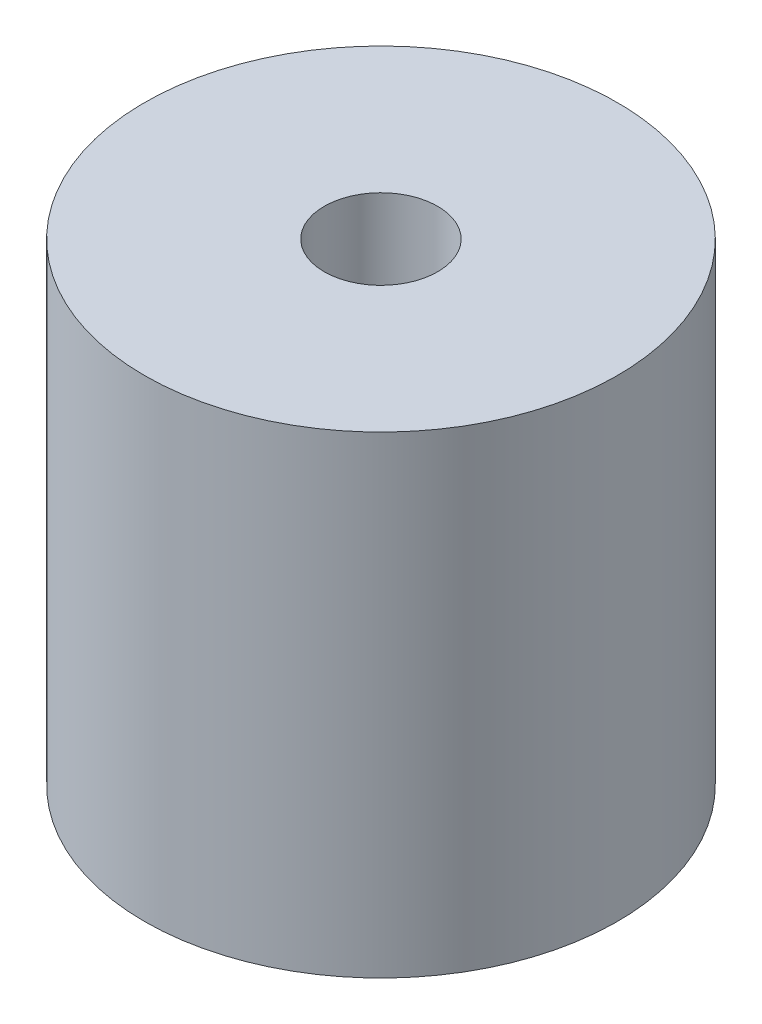
ISO-10303-21;
HEADER;
FILE_DESCRIPTION(('STEP AP214'),'2;1');
FILE_NAME('part.step','',(''),(''),'','','');
FILE_SCHEMA(('AUTOMOTIVE_DESIGN { 1 0 10303 214 1 1 1 1 }'));
ENDSEC;
DATA;
#1=APPLICATION_CONTEXT('core data for automotive mechanical design processes');
#2=APPLICATION_PROTOCOL_DEFINITION('international standard','automotive_design',2000,#1);
#3=PRODUCT_CONTEXT('',#1,'mechanical');
#4=PRODUCT('Part','Part','',(#3));
#5=PRODUCT_RELATED_PRODUCT_CATEGORY('part','',(#4));
#6=PRODUCT_DEFINITION_FORMATION('','',#4);
#7=PRODUCT_DEFINITION_CONTEXT('part definition',#1,'design');
#8=PRODUCT_DEFINITION('design','',#6,#7);
#9=PRODUCT_DEFINITION_SHAPE('','',#8);
#10=(LENGTH_UNIT() NAMED_UNIT(*) SI_UNIT(.MILLI.,.METRE.));
#11=(NAMED_UNIT(*) PLANE_ANGLE_UNIT() SI_UNIT($,.RADIAN.));
#12=(NAMED_UNIT(*) SI_UNIT($,.STERADIAN.) SOLID_ANGLE_UNIT());
#13=UNCERTAINTY_MEASURE_WITH_UNIT(LENGTH_MEASURE(1.E-05),#10,'distance_accuracy_value','');
#14=(GEOMETRIC_REPRESENTATION_CONTEXT(3) GLOBAL_UNCERTAINTY_ASSIGNED_CONTEXT((#13)) GLOBAL_UNIT_ASSIGNED_CONTEXT((#10,
#11,#12)) REPRESENTATION_CONTEXT('',''));
#15=CARTESIAN_POINT('',(0.,0.,0.));
#16=DIRECTION('',(0.,0.,1.));
#17=DIRECTION('',(1.,0.,0.));
#18=AXIS2_PLACEMENT_3D('',#15,#16,#17);
#19=CARTESIAN_POINT('',(0.,35.,0.));
#20=DIRECTION('',(0.,-1.,0.));
#21=DIRECTION('',(0.,0.,-1.));
#22=AXIS2_PLACEMENT_3D('',#19,#20,#21);
#23=CYLINDRICAL_SURFACE('',#22,17.5);
#24=CARTESIAN_POINT('',(0.,35.,0.));
#25=DIRECTION('',(0.,1.,0.));
#26=DIRECTION('',(0.,0.,1.));
#27=AXIS2_PLACEMENT_3D('',#24,#25,#26);
#28=CIRCLE('',#27,17.5);
#29=CARTESIAN_POINT('',(0.,35.,17.5));
#30=VERTEX_POINT('',#29);
#31=EDGE_CURVE('E57',#30,#30,#28,.T.);
#32=ORIENTED_EDGE('',*,*,#31,.F.);
#33=EDGE_LOOP('',(#32));
#34=FACE_BOUND('',#33,.T.);
#35=CARTESIAN_POINT('',(0.,0.,0.));
#36=DIRECTION('',(0.,1.,0.));
#37=DIRECTION('',(0.,0.,1.));
#38=AXIS2_PLACEMENT_3D('',#35,#36,#37);
#39=CIRCLE('',#38,17.5);
#40=CARTESIAN_POINT('',(0.,0.,17.5));
#41=VERTEX_POINT('',#40);
#42=EDGE_CURVE('E61',#41,#41,#39,.T.);
#43=ORIENTED_EDGE('',*,*,#42,.T.);
#44=EDGE_LOOP('',(#43));
#45=FACE_BOUND('',#44,.T.);
#46=ADVANCED_FACE('F46',(#34,#45),#23,.T.);
#47=CARTESIAN_POINT('',(0.,35.,0.));
#48=DIRECTION('',(0.,1.,0.));
#49=DIRECTION('',(0.,0.,1.));
#50=AXIS2_PLACEMENT_3D('',#47,#48,#49);
#51=PLANE('',#50);
#52=CARTESIAN_POINT('',(0.,35.,0.));
#53=DIRECTION('',(0.,1.,0.));
#54=DIRECTION('',(0.,0.,1.));
#55=AXIS2_PLACEMENT_3D('',#52,#53,#54);
#56=CIRCLE('',#55,4.2);
#57=CARTESIAN_POINT('',(0.,35.,4.2));
#58=VERTEX_POINT('',#57);
#59=EDGE_CURVE('E67',#58,#58,#56,.T.);
#60=ORIENTED_EDGE('',*,*,#59,.F.);
#61=EDGE_LOOP('',(#60));
#62=FACE_BOUND('',#61,.T.);
#63=ORIENTED_EDGE('',*,*,#31,.T.);
#64=EDGE_LOOP('',(#63));
#65=FACE_BOUND('',#64,.T.);
#66=ADVANCED_FACE('F91',(#62,#65),#51,.T.);
#67=CARTESIAN_POINT('',(0.,0.,0.));
#68=DIRECTION('',(0.,1.,0.));
#69=DIRECTION('',(0.,0.,1.));
#70=AXIS2_PLACEMENT_3D('',#67,#68,#69);
#71=PLANE('',#70);
#72=CARTESIAN_POINT('',(0.,0.,0.));
#73=DIRECTION('',(0.,1.,0.));
#74=DIRECTION('',(0.,0.,1.));
#75=AXIS2_PLACEMENT_3D('',#72,#73,#74);
#76=CIRCLE('',#75,1.7);
#77=CARTESIAN_POINT('',(0.,0.,1.7));
#78=VERTEX_POINT('',#77);
#79=EDGE_CURVE('E70',#78,#78,#76,.T.);
#80=ORIENTED_EDGE('',*,*,#79,.T.);
#81=EDGE_LOOP('',(#80));
#82=FACE_BOUND('',#81,.T.);
#83=ORIENTED_EDGE('',*,*,#42,.F.);
#84=EDGE_LOOP('',(#83));
#85=FACE_BOUND('',#84,.T.);
#86=ADVANCED_FACE('F76',(#82,#85),#71,.F.);
#87=CARTESIAN_POINT('',(0.,25.,0.));
#88=DIRECTION('',(0.,1.,0.));
#89=DIRECTION('',(0.,0.,1.));
#90=AXIS2_PLACEMENT_3D('',#87,#88,#89);
#91=CYLINDRICAL_SURFACE('',#90,4.2);
#92=CARTESIAN_POINT('',(0.,25.,0.));
#93=DIRECTION('',(0.,1.,0.));
#94=DIRECTION('',(0.,0.,1.));
#95=AXIS2_PLACEMENT_3D('',#92,#93,#94);
#96=CIRCLE('',#95,4.2);
#97=CARTESIAN_POINT('',(0.,25.,4.2));
#98=VERTEX_POINT('',#97);
#99=EDGE_CURVE('E65',#98,#98,#96,.T.);
#100=ORIENTED_EDGE('',*,*,#99,.F.);
#101=EDGE_LOOP('',(#100));
#102=FACE_BOUND('',#101,.T.);
#103=ORIENTED_EDGE('',*,*,#59,.T.);
#104=EDGE_LOOP('',(#103));
#105=FACE_BOUND('',#104,.T.);
#106=ADVANCED_FACE('F88',(#102,#105),#91,.F.);
#107=CARTESIAN_POINT('',(0.,25.,0.));
#108=DIRECTION('',(0.,1.,0.));
#109=DIRECTION('',(0.,0.,1.));
#110=AXIS2_PLACEMENT_3D('',#107,#108,#109);
#111=PLANE('',#110);
#112=CARTESIAN_POINT('',(0.,25.,0.));
#113=DIRECTION('',(0.,1.,0.));
#114=DIRECTION('',(0.,0.,1.));
#115=AXIS2_PLACEMENT_3D('',#112,#113,#114);
#116=CIRCLE('',#115,4.1892);
#117=CARTESIAN_POINT('',(0.,25.,4.1892));
#118=VERTEX_POINT('',#117);
#119=EDGE_CURVE('E11',#118,#118,#116,.F.);
#120=ORIENTED_EDGE('',*,*,#119,.T.);
#121=EDGE_LOOP('',(#120));
#122=FACE_BOUND('',#121,.T.);
#123=ORIENTED_EDGE('',*,*,#99,.T.);
#124=EDGE_LOOP('',(#123));
#125=FACE_BOUND('',#124,.T.);
#126=ADVANCED_FACE('F81',(#122,#125),#111,.T.);
#127=CARTESIAN_POINT('',(0.,0.,0.));
#128=DIRECTION('',(0.,1.,0.));
#129=DIRECTION('',(0.,0.,1.));
#130=AXIS2_PLACEMENT_3D('',#127,#128,#129);
#131=CYLINDRICAL_SURFACE('',#130,1.7);
#132=CARTESIAN_POINT('',(0.,22.5108,0.));
#133=DIRECTION('',(0.,1.,0.));
#134=DIRECTION('',(0.,0.,1.));
#135=AXIS2_PLACEMENT_3D('',#132,#133,#134);
#136=CIRCLE('',#135,1.7);
#137=CARTESIAN_POINT('',(0.,22.5108,1.7));
#138=VERTEX_POINT('',#137);
#139=EDGE_CURVE('E53',#138,#138,#136,.T.);
#140=ORIENTED_EDGE('',*,*,#139,.T.);
#141=EDGE_LOOP('',(#140));
#142=FACE_BOUND('',#141,.T.);
#143=ORIENTED_EDGE('',*,*,#79,.F.);
#144=EDGE_LOOP('',(#143));
#145=FACE_BOUND('',#144,.T.);
#146=ADVANCED_FACE('F79',(#142,#145),#131,.F.);
#147=CARTESIAN_POINT('',(0.,22.5108,0.));
#148=DIRECTION('',(0.,1.,0.));
#149=DIRECTION('',(0.,0.,1.));
#150=AXIS2_PLACEMENT_3D('',#147,#148,#149);
#151=CONICAL_SURFACE('',#150,1.7,0.785398163397451);
#152=ORIENTED_EDGE('',*,*,#119,.F.);
#153=EDGE_LOOP('',(#152));
#154=FACE_BOUND('',#153,.T.);
#155=ORIENTED_EDGE('',*,*,#139,.F.);
#156=EDGE_LOOP('',(#155));
#157=FACE_BOUND('',#156,.T.);
#158=ADVANCED_FACE('F48',(#154,#157),#151,.F.);
#159=CLOSED_SHELL('',(#46,#66,#86,#106,#126,#146,#158));
#160=MANIFOLD_SOLID_BREP('B2',#159);
#161=ADVANCED_BREP_SHAPE_REPRESENTATION('',(#18,#160),#14);
#162=SHAPE_DEFINITION_REPRESENTATION(#9,#161);
ENDSEC;
END-ISO-10303-21;
